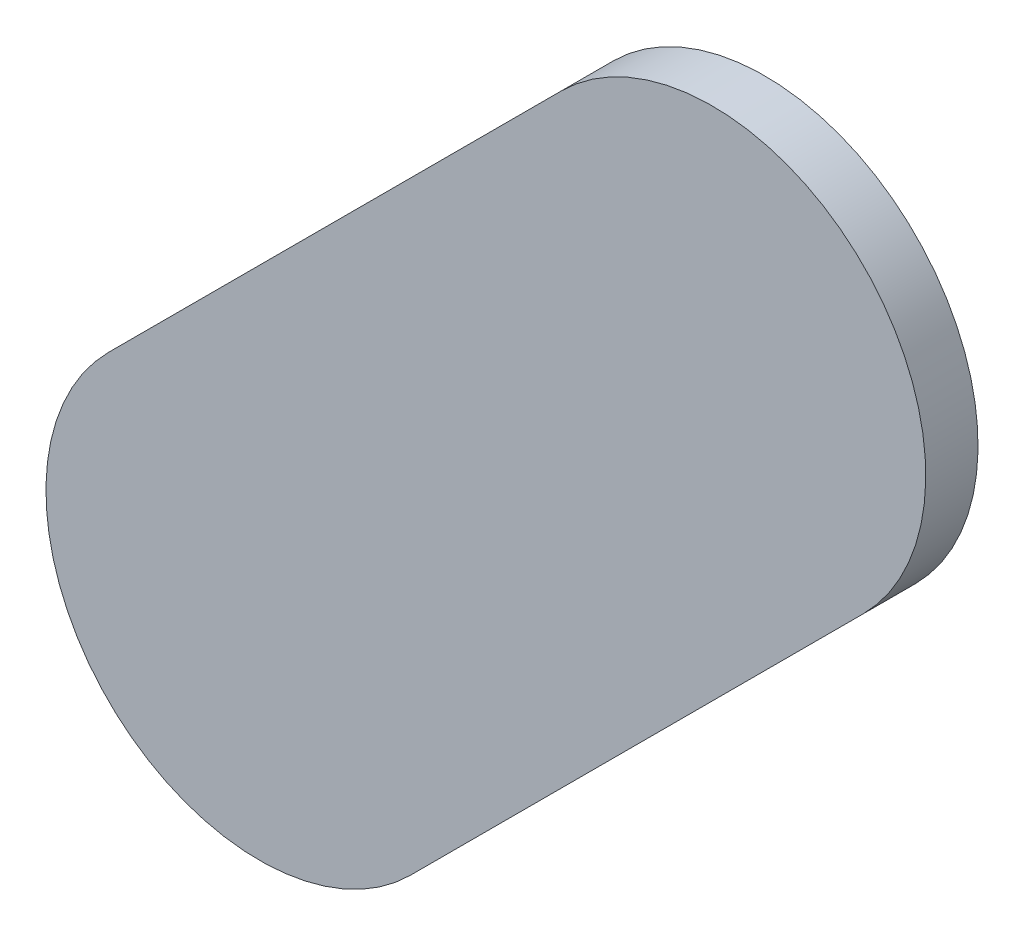
ISO-10303-21;
HEADER;
FILE_DESCRIPTION(('STEP AP214'),'2;1');
FILE_NAME('part.step','',(''),(''),'','','');
FILE_SCHEMA(('AUTOMOTIVE_DESIGN { 1 0 10303 214 1 1 1 1 }'));
ENDSEC;
DATA;
#1=APPLICATION_CONTEXT('core data for automotive mechanical design processes');
#2=APPLICATION_PROTOCOL_DEFINITION('international standard','automotive_design',2000,#1);
#3=PRODUCT_CONTEXT('',#1,'mechanical');
#4=PRODUCT('Part','Part','',(#3));
#5=PRODUCT_RELATED_PRODUCT_CATEGORY('part','',(#4));
#6=PRODUCT_DEFINITION_FORMATION('','',#4);
#7=PRODUCT_DEFINITION_CONTEXT('part definition',#1,'design');
#8=PRODUCT_DEFINITION('design','',#6,#7);
#9=PRODUCT_DEFINITION_SHAPE('','',#8);
#10=(LENGTH_UNIT() NAMED_UNIT(*) SI_UNIT(.MILLI.,.METRE.));
#11=(NAMED_UNIT(*) PLANE_ANGLE_UNIT() SI_UNIT($,.RADIAN.));
#12=(NAMED_UNIT(*) SI_UNIT($,.STERADIAN.) SOLID_ANGLE_UNIT());
#13=UNCERTAINTY_MEASURE_WITH_UNIT(LENGTH_MEASURE(1.E-05),#10,'distance_accuracy_value','');
#14=(GEOMETRIC_REPRESENTATION_CONTEXT(3) GLOBAL_UNCERTAINTY_ASSIGNED_CONTEXT((#13)) GLOBAL_UNIT_ASSIGNED_CONTEXT((#10,
#11,#12)) REPRESENTATION_CONTEXT('',''));
#15=CARTESIAN_POINT('',(0.,0.,0.));
#16=DIRECTION('',(0.,0.,1.));
#17=DIRECTION('',(1.,0.,0.));
#18=AXIS2_PLACEMENT_3D('',#15,#16,#17);
#19=CARTESIAN_POINT('',(3.018928089748,3.859588644465,0.79916));
#20=DIRECTION('',(0.,0.,1.));
#21=DIRECTION('',(1.,0.,0.));
#22=AXIS2_PLACEMENT_3D('',#19,#20,#21);
#23=PLANE('',#22);
#24=CARTESIAN_POINT('',(2.870435333,3.711096,0.79916));
#25=DIRECTION('',(0.,0.,1.));
#26=DIRECTION('',(1.,0.,0.));
#27=AXIS2_PLACEMENT_3D('',#24,#25,#26);
#28=CIRCLE('',#27,0.139999666);
#29=CARTESIAN_POINT('',(2.96943065012217,3.61210131612202,0.79916));
#30=VERTEX_POINT('',#29);
#31=CARTESIAN_POINT('',(2.77144073875643,3.81009083214002,0.79916));
#32=VERTEX_POINT('',#31);
#33=EDGE_CURVE('E20',#30,#32,#28,.F.);
#34=ORIENTED_EDGE('',*,*,#33,.F.);
#35=DIRECTION('',(-0.707106660628037,-0.707106901745037,0.));
#36=VECTOR('',#35,1.);
#37=CARTESIAN_POINT('',(3.266415282866,3.909086050135,0.79916));
#38=LINE('',#37,#36);
#39=CARTESIAN_POINT('',(3.26641545805481,3.90908622532387,0.79916));
#40=VERTEX_POINT('',#39);
#41=EDGE_CURVE('E65',#30,#40,#38,.F.);
#42=ORIENTED_EDGE('',*,*,#41,.T.);
#43=CARTESIAN_POINT('',(3.167420333,4.008081101268,0.79916));
#44=DIRECTION('',(0.,0.,1.));
#45=DIRECTION('',(1.,0.,0.));
#46=AXIS2_PLACEMENT_3D('',#43,#44,#45);
#47=CIRCLE('',#46,0.14);
#48=CARTESIAN_POINT('',(3.0684253105155,4.10707597751572,0.79916));
#49=VERTEX_POINT('',#48);
#50=EDGE_CURVE('E57',#49,#40,#47,.F.);
#51=ORIENTED_EDGE('',*,*,#50,.F.);
#52=DIRECTION('',(0.707106098309218,0.707107464063218,0.));
#53=VECTOR('',#52,1.);
#54=CARTESIAN_POINT('',(2.771440953307,3.810091046691,0.79916));
#55=LINE('',#54,#53);
#56=EDGE_CURVE('E64',#49,#32,#55,.F.);
#57=ORIENTED_EDGE('',*,*,#56,.T.);
#58=EDGE_LOOP('',(#34,#42,#51,#57));
#59=FACE_BOUND('',#58,.T.);
#60=ADVANCED_FACE('F17',(#59),#23,.T.);
#61=CARTESIAN_POINT('',(3.266415282866,3.909086050135,0.76487));
#62=DIRECTION('',(-0.707106901745037,0.707106660628037,0.));
#63=DIRECTION('',(-0.707106660628037,-0.707106901745037,0.));
#64=AXIS2_PLACEMENT_3D('',#61,#62,#63);
#65=PLANE('',#64);
#66=DIRECTION('',(0.,0.,1.));
#67=VECTOR('',#66,1.);
#68=CARTESIAN_POINT('',(2.9694306670001,3.6121013329999,0.76487));
#69=LINE('',#68,#67);
#70=CARTESIAN_POINT('',(2.96943065012214,3.61210131612203,0.76487));
#71=VERTEX_POINT('',#70);
#72=EDGE_CURVE('E68',#71,#30,#69,.T.);
#73=ORIENTED_EDGE('',*,*,#72,.F.);
#74=DIRECTION('',(-0.707106660628129,-0.707106901744946,0.));
#75=VECTOR('',#74,1.);
#76=CARTESIAN_POINT('',(3.266415282866,3.909086050135,0.76487));
#77=LINE('',#76,#75);
#78=CARTESIAN_POINT('',(3.26641545805481,3.90908622532387,0.76487));
#79=VERTEX_POINT('',#78);
#80=EDGE_CURVE('E72',#79,#71,#77,.T.);
#81=ORIENTED_EDGE('',*,*,#80,.F.);
#82=DIRECTION('',(0.,0.,1.));
#83=VECTOR('',#82,1.);
#84=CARTESIAN_POINT('',(3.266415282866,3.909086050135,0.76487));
#85=LINE('',#84,#83);
#86=EDGE_CURVE('E60',#40,#79,#85,.F.);
#87=ORIENTED_EDGE('',*,*,#86,.F.);
#88=ORIENTED_EDGE('',*,*,#41,.F.);
#89=EDGE_LOOP('',(#73,#81,#87,#88));
#90=FACE_BOUND('',#89,.T.);
#91=ADVANCED_FACE('F70',(#90),#65,.F.);
#92=CARTESIAN_POINT('',(2.870435333,3.711096,0.76487));
#93=DIRECTION('',(0.,0.,1.));
#94=DIRECTION('',(1.,0.,0.));
#95=AXIS2_PLACEMENT_3D('',#92,#93,#94);
#96=CYLINDRICAL_SURFACE('',#95,0.139999666);
#97=DIRECTION('',(0.,0.,1.));
#98=VECTOR('',#97,1.);
#99=CARTESIAN_POINT('',(2.771440953307,3.810091046691,0.76487));
#100=LINE('',#99,#98);
#101=CARTESIAN_POINT('',(2.77144073875646,3.81009083214004,0.76487));
#102=VERTEX_POINT('',#101);
#103=EDGE_CURVE('E77',#32,#102,#100,.F.);
#104=ORIENTED_EDGE('',*,*,#103,.T.);
#105=CARTESIAN_POINT('',(2.870435667,3.711096231732,0.76487));
#106=DIRECTION('',(0.,0.,1.));
#107=DIRECTION('',(1.,0.,0.));
#108=AXIS2_PLACEMENT_3D('',#105,#106,#107);
#109=CIRCLE('',#108,0.14);
#110=EDGE_CURVE('E26',#71,#102,#109,.F.);
#111=ORIENTED_EDGE('',*,*,#110,.F.);
#112=ORIENTED_EDGE('',*,*,#72,.T.);
#113=ORIENTED_EDGE('',*,*,#33,.T.);
#114=EDGE_LOOP('',(#104,#111,#112,#113));
#115=FACE_BOUND('',#114,.T.);
#116=ADVANCED_FACE('F88',(#115),#96,.T.);
#117=CARTESIAN_POINT('',(2.771440953307,3.810091046691,0.76487));
#118=DIRECTION('',(0.707107464063218,-0.707106098309218,0.));
#119=DIRECTION('',(0.707106098309218,0.707107464063218,0.));
#120=AXIS2_PLACEMENT_3D('',#117,#118,#119);
#121=PLANE('',#120);
#122=DIRECTION('',(0.,0.,1.));
#123=VECTOR('',#122,1.);
#124=CARTESIAN_POINT('',(3.0684253329999,4.1070760000001,0.76487));
#125=LINE('',#124,#123);
#126=CARTESIAN_POINT('',(3.06842531051561,4.10707597751567,0.76487));
#127=VERTEX_POINT('',#126);
#128=EDGE_CURVE('E62',#127,#49,#125,.T.);
#129=ORIENTED_EDGE('',*,*,#128,.F.);
#130=DIRECTION('',(0.707106098309609,0.707107464062827,0.));
#131=VECTOR('',#130,1.);
#132=CARTESIAN_POINT('',(2.771440953307,3.810091046691,0.76487));
#133=LINE('',#132,#131);
#134=EDGE_CURVE('E11',#102,#127,#133,.T.);
#135=ORIENTED_EDGE('',*,*,#134,.F.);
#136=ORIENTED_EDGE('',*,*,#103,.F.);
#137=ORIENTED_EDGE('',*,*,#56,.F.);
#138=EDGE_LOOP('',(#129,#135,#136,#137));
#139=FACE_BOUND('',#138,.T.);
#140=ADVANCED_FACE('F96',(#139),#121,.F.);
#141=CARTESIAN_POINT('',(3.167420333,4.008081101268,0.76487));
#142=DIRECTION('',(0.,0.,1.));
#143=DIRECTION('',(1.,0.,0.));
#144=AXIS2_PLACEMENT_3D('',#141,#142,#143);
#145=CYLINDRICAL_SURFACE('',#144,0.14);
#146=CARTESIAN_POINT('',(3.167420667,4.008081333,0.76487));
#147=DIRECTION('',(0.,0.,1.));
#148=DIRECTION('',(1.,0.,0.));
#149=AXIS2_PLACEMENT_3D('',#146,#147,#148);
#150=CIRCLE('',#149,0.14);
#151=EDGE_CURVE('E35',#127,#79,#150,.F.);
#152=ORIENTED_EDGE('',*,*,#151,.F.);
#153=ORIENTED_EDGE('',*,*,#128,.T.);
#154=ORIENTED_EDGE('',*,*,#50,.T.);
#155=ORIENTED_EDGE('',*,*,#86,.T.);
#156=EDGE_LOOP('',(#152,#153,#154,#155));
#157=FACE_BOUND('',#156,.T.);
#158=ADVANCED_FACE('F58',(#157),#145,.T.);
#159=CARTESIAN_POINT('',(3.018928089748,3.859588644465,0.76487));
#160=DIRECTION('',(0.,0.,-1.));
#161=DIRECTION('',(-1.,0.,0.));
#162=AXIS2_PLACEMENT_3D('',#159,#160,#161);
#163=PLANE('',#162);
#164=ORIENTED_EDGE('',*,*,#134,.T.);
#165=ORIENTED_EDGE('',*,*,#151,.T.);
#166=ORIENTED_EDGE('',*,*,#80,.T.);
#167=ORIENTED_EDGE('',*,*,#110,.T.);
#168=EDGE_LOOP('',(#164,#165,#166,#167));
#169=FACE_BOUND('',#168,.T.);
#170=ADVANCED_FACE('F89',(#169),#163,.T.);
#171=CLOSED_SHELL('',(#60,#91,#116,#140,#158,#170));
#172=MANIFOLD_SOLID_BREP('B1',#171);
#173=ADVANCED_BREP_SHAPE_REPRESENTATION('',(#18,#172),#14);
#174=SHAPE_DEFINITION_REPRESENTATION(#9,#173);
ENDSEC;
END-ISO-10303-21;
